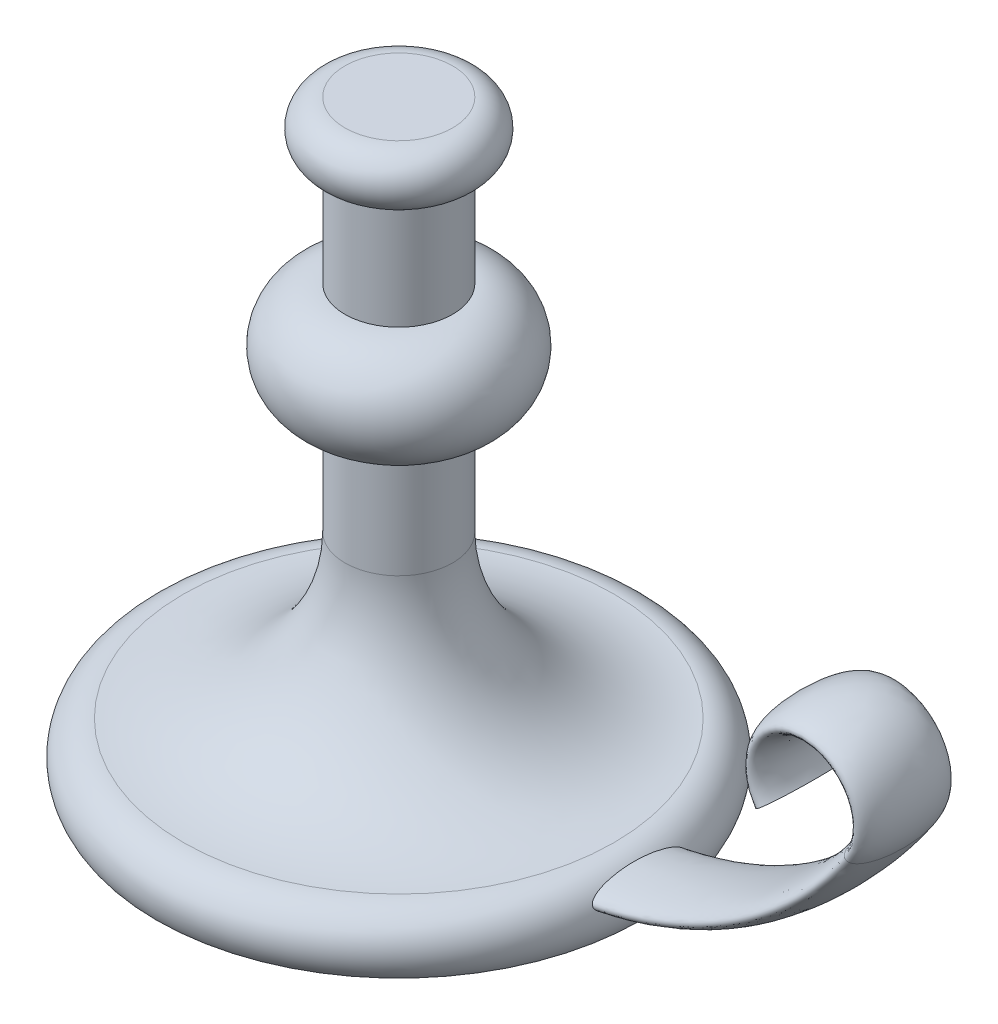
ISO-10303-21;
HEADER;
FILE_DESCRIPTION(('STEP AP214'),'2;1');
FILE_NAME('part.step','',(''),(''),'','','');
FILE_SCHEMA(('AUTOMOTIVE_DESIGN { 1 0 10303 214 1 1 1 1 }'));
ENDSEC;
DATA;
#1=APPLICATION_CONTEXT('core data for automotive mechanical design processes');
#2=APPLICATION_PROTOCOL_DEFINITION('international standard','automotive_design',2000,#1);
#3=PRODUCT_CONTEXT('',#1,'mechanical');
#4=PRODUCT('Part','Part','',(#3));
#5=PRODUCT_RELATED_PRODUCT_CATEGORY('part','',(#4));
#6=PRODUCT_DEFINITION_FORMATION('','',#4);
#7=PRODUCT_DEFINITION_CONTEXT('part definition',#1,'design');
#8=PRODUCT_DEFINITION('design','',#6,#7);
#9=PRODUCT_DEFINITION_SHAPE('','',#8);
#10=(LENGTH_UNIT() NAMED_UNIT(*) SI_UNIT(.MILLI.,.METRE.));
#11=(NAMED_UNIT(*) PLANE_ANGLE_UNIT() SI_UNIT($,.RADIAN.));
#12=(NAMED_UNIT(*) SI_UNIT($,.STERADIAN.) SOLID_ANGLE_UNIT());
#13=UNCERTAINTY_MEASURE_WITH_UNIT(LENGTH_MEASURE(1.E-05),#10,'distance_accuracy_value','');
#14=(GEOMETRIC_REPRESENTATION_CONTEXT(3) GLOBAL_UNCERTAINTY_ASSIGNED_CONTEXT((#13)) GLOBAL_UNIT_ASSIGNED_CONTEXT((#10,
#11,#12)) REPRESENTATION_CONTEXT('',''));
#15=CARTESIAN_POINT('',(0.,0.,0.));
#16=DIRECTION('',(0.,0.,1.));
#17=DIRECTION('',(1.,0.,0.));
#18=AXIS2_PLACEMENT_3D('',#15,#16,#17);
#19=CARTESIAN_POINT('',(0.,220.,0.));
#20=DIRECTION('',(0.,-1.,0.));
#21=DIRECTION('',(0.,0.,-1.));
#22=AXIS2_PLACEMENT_3D('',#19,#20,#21);
#23=PLANE('',#22);
#24=CARTESIAN_POINT('',(0.,220.,0.));
#25=DIRECTION('',(0.,1.,0.));
#26=DIRECTION('',(0.,0.,1.));
#27=AXIS2_PLACEMENT_3D('',#24,#25,#26);
#28=CIRCLE('',#27,20.);
#29=CARTESIAN_POINT('',(0.,220.,20.));
#30=VERTEX_POINT('',#29);
#31=EDGE_CURVE('E10',#30,#30,#28,.T.);
#32=ORIENTED_EDGE('',*,*,#31,.T.);
#33=EDGE_LOOP('',(#32));
#34=FACE_BOUND('',#33,.T.);
#35=ADVANCED_FACE('F39',(#34),#23,.F.);
#36=CARTESIAN_POINT('',(0.,210.,0.));
#37=DIRECTION('',(0.,1.,0.));
#38=DIRECTION('',(0.,0.,1.));
#39=AXIS2_PLACEMENT_3D('',#36,#37,#38);
#40=TOROIDAL_SURFACE('',#39,20.,9.99999999999999);
#41=ORIENTED_EDGE('',*,*,#31,.F.);
#42=EDGE_LOOP('',(#41));
#43=FACE_BOUND('',#42,.T.);
#44=CARTESIAN_POINT('',(0.,200.,0.));
#45=DIRECTION('',(0.,1.,0.));
#46=DIRECTION('',(0.,0.,1.));
#47=AXIS2_PLACEMENT_3D('',#44,#45,#46);
#48=CIRCLE('',#47,20.);
#49=CARTESIAN_POINT('',(0.,200.,20.));
#50=VERTEX_POINT('',#49);
#51=EDGE_CURVE('E52',#50,#50,#48,.T.);
#52=ORIENTED_EDGE('',*,*,#51,.T.);
#53=EDGE_LOOP('',(#52));
#54=FACE_BOUND('',#53,.T.);
#55=ADVANCED_FACE('F113',(#43,#54),#40,.T.);
#56=CARTESIAN_POINT('',(0.,220.,0.));
#57=DIRECTION('',(0.,1.,0.));
#58=DIRECTION('',(0.,0.,1.));
#59=AXIS2_PLACEMENT_3D('',#56,#57,#58);
#60=CYLINDRICAL_SURFACE('',#59,20.);
#61=ORIENTED_EDGE('',*,*,#51,.F.);
#62=EDGE_LOOP('',(#61));
#63=FACE_BOUND('',#62,.T.);
#64=CARTESIAN_POINT('',(0.,160.,0.));
#65=DIRECTION('',(0.,1.,0.));
#66=DIRECTION('',(0.,0.,1.));
#67=AXIS2_PLACEMENT_3D('',#64,#65,#66);
#68=CIRCLE('',#67,20.);
#69=CARTESIAN_POINT('',(0.,160.,20.));
#70=VERTEX_POINT('',#69);
#71=EDGE_CURVE('E57',#70,#70,#68,.T.);
#72=ORIENTED_EDGE('',*,*,#71,.T.);
#73=EDGE_LOOP('',(#72));
#74=FACE_BOUND('',#73,.T.);
#75=ADVANCED_FACE('F117',(#63,#74),#60,.T.);
#76=CARTESIAN_POINT('',(0.,140.,0.));
#77=DIRECTION('',(0.,1.,0.));
#78=DIRECTION('',(0.,0.,1.));
#79=AXIS2_PLACEMENT_3D('',#76,#77,#78);
#80=TOROIDAL_SURFACE('',#79,20.,20.);
#81=ORIENTED_EDGE('',*,*,#71,.F.);
#82=EDGE_LOOP('',(#81));
#83=FACE_BOUND('',#82,.T.);
#84=CARTESIAN_POINT('',(0.,120.,0.));
#85=DIRECTION('',(0.,1.,0.));
#86=DIRECTION('',(0.,0.,1.));
#87=AXIS2_PLACEMENT_3D('',#84,#85,#86);
#88=CIRCLE('',#87,20.);
#89=CARTESIAN_POINT('',(0.,120.,20.));
#90=VERTEX_POINT('',#89);
#91=EDGE_CURVE('E63',#90,#90,#88,.T.);
#92=ORIENTED_EDGE('',*,*,#91,.T.);
#93=EDGE_LOOP('',(#92));
#94=FACE_BOUND('',#93,.T.);
#95=ADVANCED_FACE('F122',(#83,#94),#80,.T.);
#96=CARTESIAN_POINT('',(0.,220.,0.));
#97=DIRECTION('',(0.,1.,0.));
#98=DIRECTION('',(0.,0.,1.));
#99=AXIS2_PLACEMENT_3D('',#96,#97,#98);
#100=CYLINDRICAL_SURFACE('',#99,20.);
#101=ORIENTED_EDGE('',*,*,#91,.F.);
#102=EDGE_LOOP('',(#101));
#103=FACE_BOUND('',#102,.T.);
#104=CARTESIAN_POINT('',(0.,80.,0.));
#105=DIRECTION('',(0.,1.,0.));
#106=DIRECTION('',(0.,0.,1.));
#107=AXIS2_PLACEMENT_3D('',#104,#105,#106);
#108=CIRCLE('',#107,20.);
#109=CARTESIAN_POINT('',(0.,80.,20.));
#110=VERTEX_POINT('',#109);
#111=EDGE_CURVE('E67',#110,#110,#108,.T.);
#112=ORIENTED_EDGE('',*,*,#111,.T.);
#113=EDGE_LOOP('',(#112));
#114=FACE_BOUND('',#113,.T.);
#115=ADVANCED_FACE('F129',(#103,#114),#100,.T.);
#116=CARTESIAN_POINT('',(0.,80.,0.));
#117=DIRECTION('',(0.,1.,0.));
#118=DIRECTION('',(0.,0.,1.));
#119=AXIS2_PLACEMENT_3D('',#116,#117,#118);
#120=TOROIDAL_SURFACE('',#119,80.,60.);
#121=ORIENTED_EDGE('',*,*,#111,.F.);
#122=EDGE_LOOP('',(#121));
#123=FACE_BOUND('',#122,.T.);
#124=CARTESIAN_POINT('',(0.,20.,0.));
#125=DIRECTION('',(0.,1.,0.));
#126=DIRECTION('',(0.,0.,1.));
#127=AXIS2_PLACEMENT_3D('',#124,#125,#126);
#128=CIRCLE('',#127,80.);
#129=CARTESIAN_POINT('',(0.,20.,80.));
#130=VERTEX_POINT('',#129);
#131=EDGE_CURVE('E71',#130,#130,#128,.T.);
#132=ORIENTED_EDGE('',*,*,#131,.T.);
#133=EDGE_LOOP('',(#132));
#134=FACE_BOUND('',#133,.T.);
#135=ADVANCED_FACE('F102',(#123,#134),#120,.F.);
#136=CARTESIAN_POINT('',(0.,7.50000000000001,0.));
#137=DIRECTION('',(0.,1.,0.));
#138=DIRECTION('',(0.,0.,1.));
#139=AXIS2_PLACEMENT_3D('',#136,#137,#138);
#140=TOROIDAL_SURFACE('',#139,79.9999999999999,12.5);
#141=CARTESIAN_POINT('',(89.5597422043341,12.9414346567555,-17.5));
#142=CARTESIAN_POINT('',(89.5807278946485,12.8988393157081,-17.5000019534777));
#143=CARTESIAN_POINT('',(89.6018125795404,12.8563039357769,-17.4977816975197));
#144=CARTESIAN_POINT('',(89.6440155813562,12.7716938339371,-17.489002543543));
#145=CARTESIAN_POINT('',(89.6651339056646,12.7296192360718,-17.4824425050804));
#146=CARTESIAN_POINT('',(89.7283289297819,12.6045076597417,-17.4565216692094));
#147=CARTESIAN_POINT('',(89.7702246464786,12.5226255894255,-17.4309204730636));
#148=CARTESIAN_POINT('',(89.8644276523312,12.3407735771966,-17.3563532007827));
#149=CARTESIAN_POINT('',(89.9162117483189,12.242484901666,-17.3027527423027));
#150=CARTESIAN_POINT('',(90.01638786814,12.0551458272008,-17.178826321144));
#151=CARTESIAN_POINT('',(90.0647710548456,11.966119226993,-17.1084587296403));
#152=CARTESIAN_POINT('',(90.1524531790238,11.806984522925,-16.9652391551481));
#153=CARTESIAN_POINT('',(90.1921458014335,11.7358878994478,-16.8936963434585));
#154=CARTESIAN_POINT('',(90.2690886261224,11.5996259068224,-16.7438969488311));
#155=CARTESIAN_POINT('',(90.3063367280021,11.5344656201532,-16.665634722265));
#156=CARTESIAN_POINT('',(90.3786756485819,11.4092540815105,-16.5039763875565));
#157=CARTESIAN_POINT('',(90.4137624747614,11.349212210629,-16.4205713158719));
#158=CARTESIAN_POINT('',(90.4819450166471,11.2336894025401,-16.2499454917114));
#159=CARTESIAN_POINT('',(90.5150413047902,11.1782071523834,-16.162725848809));
#160=CARTESIAN_POINT('',(90.58397059301,11.0637251825689,-15.9728919395737));
#161=CARTESIAN_POINT('',(90.6195406839562,11.0053156128849,-15.8698282905888));
#162=CARTESIAN_POINT('',(90.6886668526269,10.8929143897208,-15.6606649910659));
#163=CARTESIAN_POINT('',(90.7222226971281,10.8389232475745,-15.5545649910506));
#164=CARTESIAN_POINT('',(90.7874864861339,10.7348751403119,-15.3401290691865));
#165=CARTESIAN_POINT('',(90.8191972688172,10.6848120890841,-15.2317969483067));
#166=CARTESIAN_POINT('',(90.881005962979,10.5880683385414,-15.0131968985225));
#167=CARTESIAN_POINT('',(90.9111039714558,10.5413874357517,-14.9029290865687));
#168=CARTESIAN_POINT('',(90.9798973633521,10.4355491517099,-14.6427529331226));
#169=CARTESIAN_POINT('',(91.0180072010883,10.377593665576,-14.4922012075481));
#170=CARTESIAN_POINT('',(91.0918875553169,10.2663462891691,-14.1888070722871));
#171=CARTESIAN_POINT('',(91.1276577411367,10.2130550577559,-14.0359643425398));
#172=CARTESIAN_POINT('',(91.1971197458645,10.1105127689612,-13.7282685712582));
#173=CARTESIAN_POINT('',(91.2308091946811,10.0612662985098,-13.573413471871));
#174=CARTESIAN_POINT('',(91.2962483962877,9.96642044574798,-13.262180104172));
#175=CARTESIAN_POINT('',(91.3279980241888,9.92082129819992,-13.1058017385396));
#176=CARTESIAN_POINT('',(91.4205951755326,9.78887458660797,-12.6346162266685));
#177=CARTESIAN_POINT('',(91.478758906098,9.70742476979594,-12.3179025042442));
#178=CARTESIAN_POINT('',(91.5890957852253,9.55493826130151,-11.6792188898602));
#179=CARTESIAN_POINT('',(91.6412365063819,9.48395741425905,-11.357230318611));
#180=CARTESIAN_POINT('',(91.7397682682943,9.35136221163196,-10.7107316640823));
#181=CARTESIAN_POINT('',(91.7861636672356,9.28974074823245,-10.3862236929834));
#182=CARTESIAN_POINT('',(91.873697660451,9.17463718318051,-9.73512886653574));
#183=CARTESIAN_POINT('',(91.9148370779325,9.12115380666533,-9.4085423451682));
#184=CARTESIAN_POINT('',(91.9930777751441,9.02031209920315,-8.74630339912618));
#185=CARTESIAN_POINT('',(92.0300669877612,8.97311921137159,-8.41061269264342));
#186=CARTESIAN_POINT('',(92.0991833927575,8.88559842477434,-7.7378325274395));
#187=CARTESIAN_POINT('',(92.1313104056235,8.84527077946751,-7.40074301754617));
#188=CARTESIAN_POINT('',(92.1909161961866,8.77092313439267,-6.72537142355351));
#189=CARTESIAN_POINT('',(92.2183937480205,8.73690479789182,-6.38708904887197));
#190=CARTESIAN_POINT('',(92.2688480816039,8.674768403045,-5.70964427774296));
#191=CARTESIAN_POINT('',(92.2918247141674,8.64665054027192,-5.37048185250305));
#192=CARTESIAN_POINT('',(92.3540877228586,8.57076604630487,-4.35367181244674));
#193=CARTESIAN_POINT('',(92.3868571977359,8.53128338370554,-3.67498389641653));
#194=CARTESIAN_POINT('',(92.4356134743347,8.47274161832894,-2.31614711504077));
#195=CARTESIAN_POINT('',(92.4515998737813,8.45368300509714,-1.63599821506831));
#196=CARTESIAN_POINT('',(92.4661200478781,8.43637339284853,-0.357955102332014));
#197=CARTESIAN_POINT('',(92.4665389208555,8.43587490179706,0.2398888561436));
#198=CARTESIAN_POINT('',(92.4546362797528,8.45006241260828,1.43536153859161));
#199=CARTESIAN_POINT('',(92.4423128974782,8.46475064105844,2.0329902181484));
#200=CARTESIAN_POINT('',(92.4047541650815,8.50976680779928,3.22745109478544));
#201=CARTESIAN_POINT('',(92.3795147316879,8.54009969200436,3.82428298010726));
#202=CARTESIAN_POINT('',(92.3157217367252,8.61743320229675,5.01694606233265));
#203=CARTESIAN_POINT('',(92.2771508465327,8.66445552395919,5.61277493756135));
#204=CARTESIAN_POINT('',(92.1861026743767,8.77678784246256,6.80153886380948));
#205=CARTESIAN_POINT('',(92.1336290020918,8.842093092625,7.394474625351));
#206=CARTESIAN_POINT('',(92.0437550848418,8.95574227206712,8.28055229820525));
#207=CARTESIAN_POINT('',(92.0119455213755,8.99622894552014,8.57528682166739));
#208=CARTESIAN_POINT('',(91.9444204496404,9.08291539794889,9.16346094428898));
#209=CARTESIAN_POINT('',(91.9087051114864,9.12911492811459,9.45690059926729));
#210=CARTESIAN_POINT('',(91.8331309715697,9.2278292933407,10.0422906036685));
#211=CARTESIAN_POINT('',(91.7932707518513,9.28034629056384,10.334240407347));
#212=CARTESIAN_POINT('',(91.7091179167369,9.39245062081633,10.9161852811054));
#213=CARTESIAN_POINT('',(91.6648247441271,9.45203884286033,11.2061801005454));
#214=CARTESIAN_POINT('',(91.571392572748,9.57931645333883,11.783819165817));
#215=CARTESIAN_POINT('',(91.5222504482681,9.64701107336928,12.0714617643074));
#216=CARTESIAN_POINT('',(91.4186796874405,9.7917273008591,12.6430805537633));
#217=CARTESIAN_POINT('',(91.3642572573634,9.868737984241,12.9270606150357));
#218=CARTESIAN_POINT('',(91.2493765391174,10.0339529747881,13.4904217181468));
#219=CARTESIAN_POINT('',(91.1889212109096,10.1221517983455,13.769804937745));
#220=CARTESIAN_POINT('',(91.0929373870873,10.2648274882364,14.1839125047649));
#221=CARTESIAN_POINT('',(91.0600757486261,10.314090418185,14.3210581267389));
#222=CARTESIAN_POINT('',(90.9923938569385,10.4165511027193,14.5933763477652));
#223=CARTESIAN_POINT('',(90.9575737807135,10.4697485018484,14.7285491237347));
#224=CARTESIAN_POINT('',(90.8810851838776,10.587845134408,15.013877492368));
#225=CARTESIAN_POINT('',(90.8391147723956,10.6533666208413,15.163696910475));
#226=CARTESIAN_POINT('',(90.7519625692611,10.7912189771816,15.4593295355901));
#227=CARTESIAN_POINT('',(90.7067794219567,10.8635527258308,15.605141014985));
#228=CARTESIAN_POINT('',(90.6128939496974,11.0160439629677,15.8905749729623));
#229=CARTESIAN_POINT('',(90.564208454431,11.0961646105686,16.0302224467125));
#230=CARTESIAN_POINT('',(90.4624897667353,11.2662530107872,16.3016394850687));
#231=CARTESIAN_POINT('',(90.4094613083908,11.3562100760681,16.4334173639363));
#232=CARTESIAN_POINT('',(90.3114276481006,11.5255085385047,16.6553108138959));
#233=CARTESIAN_POINT('',(90.2675273757817,11.6022608890605,16.747864447136));
#234=CARTESIAN_POINT('',(90.1761749534326,11.7643292238686,16.9236630994731));
#235=CARTESIAN_POINT('',(90.1287172073377,11.849658775493,17.0068929161981));
#236=CARTESIAN_POINT('',(90.0292807633425,12.0313291797368,17.160728121925));
#237=CARTESIAN_POINT('',(89.9772518064337,12.1277974407354,17.2311575389091));
#238=CARTESIAN_POINT('',(89.8965437818878,12.2800613987942,17.3212876850735));
#239=CARTESIAN_POINT('',(89.8692277989252,12.3320164153137,17.3487242132162));
#240=CARTESIAN_POINT('',(89.8138320311431,12.4382955168478,17.397521114568));
#241=CARTESIAN_POINT('',(89.7857527202501,12.4926181439799,17.4188851676711));
#242=CARTESIAN_POINT('',(89.7185869780335,12.62370480056,17.4611772226903));
#243=CARTESIAN_POINT('',(89.6792533408886,12.7013692224277,17.4790502108364));
#244=CARTESIAN_POINT('',(89.6005512815563,12.8586256339486,17.4997317533413));
#245=CARTESIAN_POINT('',(89.5611829132232,12.938216013995,17.5025524785485));
#246=CARTESIAN_POINT('',(89.4835317885696,13.0969633423244,17.4927372657774));
#247=CARTESIAN_POINT('',(89.4452490812936,13.1761202708965,17.48010063065));
#248=CARTESIAN_POINT('',(89.3707047667354,13.3318071774564,17.440649407729));
#249=CARTESIAN_POINT('',(89.3344452993771,13.4083343423532,17.4138201116179));
#250=CARTESIAN_POINT('',(89.2510611220234,13.5858554385684,17.3357126521072));
#251=CARTESIAN_POINT('',(89.2050998650831,13.6849823777221,17.279004762084));
#252=CARTESIAN_POINT('',(89.1180744174555,13.874427631182,17.1491670423826));
#253=CARTESIAN_POINT('',(89.0770301058258,13.9647099356687,17.0759737821297));
#254=CARTESIAN_POINT('',(89.0037033744711,14.1271434857572,16.9270577307039));
#255=CARTESIAN_POINT('',(88.9709541551902,14.2001945680733,16.8525208708985));
#256=CARTESIAN_POINT('',(88.9084968426189,14.340181169045,16.6970292692109));
#257=CARTESIAN_POINT('',(88.8787841266133,14.407125966577,16.6160846261891));
#258=CARTESIAN_POINT('',(88.8217814388548,14.5359995630884,16.4490709627677));
#259=CARTESIAN_POINT('',(88.7944998605826,14.5979109242413,16.3629857823209));
#260=CARTESIAN_POINT('',(88.7420667437369,14.7171734064661,16.1870697873629));
#261=CARTESIAN_POINT('',(88.7169159331092,14.7745229686602,16.0972377082949));
#262=CARTESIAN_POINT('',(88.6682699235336,14.8855899090514,15.914069930646));
#263=CARTESIAN_POINT('',(88.6447869137155,14.9392804489427,15.8207148279057));
#264=CARTESIAN_POINT('',(88.5993971939426,15.0431008843884,15.631662696143));
#265=CARTESIAN_POINT('',(88.5774907604157,15.0932301555103,15.5359652603521));
#266=CARTESIAN_POINT('',(88.5137514786219,15.2390285874188,15.2458062448784));
#267=CARTESIAN_POINT('',(88.4739596847912,15.3299685477361,15.0485147207844));
#268=CARTESIAN_POINT('',(88.3985337506614,15.5017775203628,14.6487152633384));
#269=CARTESIAN_POINT('',(88.3629029634838,15.5826384140042,14.4462032813469));
#270=CARTESIAN_POINT('',(88.2948356711211,15.7363066128674,14.0365764701684));
#271=CARTESIAN_POINT('',(88.2624142295168,15.8090761199818,13.8294450545344));
#272=CARTESIAN_POINT('',(88.200383575138,15.9473648801959,13.4126289871754));
#273=CARTESIAN_POINT('',(88.1707714189813,16.0128917338225,13.2029472733575));
#274=CARTESIAN_POINT('',(88.1139049361937,16.1377375745623,12.7814949946293));
#275=CARTESIAN_POINT('',(88.0866500408507,16.1970580597506,12.5697249473619));
#276=CARTESIAN_POINT('',(88.0276172572029,16.3244235662308,12.0912931700768));
#277=CARTESIAN_POINT('',(87.9964138193043,16.3909381265497,11.8241540502334));
#278=CARTESIAN_POINT('',(87.9367717636616,16.5165936764723,11.2878278414637));
#279=CARTESIAN_POINT('',(87.908333416442,16.5757339447663,11.0186405549261));
#280=CARTESIAN_POINT('',(87.853926628297,16.687509894896,10.4785408424869));
#281=CARTESIAN_POINT('',(87.8279593730486,16.7401424577998,10.2076276543179));
#282=CARTESIAN_POINT('',(87.778318430933,16.8395301522939,9.66451167999671));
#283=CARTESIAN_POINT('',(87.7546448506394,16.8862850108121,9.39230883453762));
#284=CARTESIAN_POINT('',(87.6869994555323,17.0182803050951,8.57578965921611));
#285=CARTESIAN_POINT('',(87.6462388525845,17.095585400369,8.02991167225266));
#286=CARTESIAN_POINT('',(87.572806551561,17.2320145687305,6.93552385093793));
#287=CARTESIAN_POINT('',(87.540133067568,17.291142656633,6.38701462497871));
#288=CARTESIAN_POINT('',(87.4828441952969,17.3930876120977,5.28955884850666));
#289=CARTESIAN_POINT('',(87.458207458868,17.4359477429325,4.74061740412309));
#290=CARTESIAN_POINT('',(87.4169410999171,17.5068884934703,3.6414610821848));
#291=CARTESIAN_POINT('',(87.4003119088602,17.534968316784,3.09124613761564));
#292=CARTESIAN_POINT('',(87.3751699481989,17.5771566462026,1.98980868968976));
#293=CARTESIAN_POINT('',(87.3666614689743,17.5912577671532,1.43858580771881));
#294=CARTESIAN_POINT('',(87.3578539704595,17.6058511840596,0.335909067642977));
#295=CARTESIAN_POINT('',(87.3575547550007,17.6063438052041,-0.215544784627731));
#296=CARTESIAN_POINT('',(87.3651677510508,17.5937352162512,-1.31815822776498));
#297=CARTESIAN_POINT('',(87.3730787250644,17.5806360547995,-1.86931785045355));
#298=CARTESIAN_POINT('',(87.3970372477743,17.5404868292745,-2.97097544678));
#299=CARTESIAN_POINT('',(87.4130850653539,17.5134363041759,-3.52147339795022));
#300=CARTESIAN_POINT('',(87.4531996813082,17.4446213827574,-4.6211213566709));
#301=CARTESIAN_POINT('',(87.4772644593793,17.4028606933017,-5.17027166874449));
#302=CARTESIAN_POINT('',(87.5333316774063,17.3033707612728,-6.26670053623853));
#303=CARTESIAN_POINT('',(87.5653334299484,17.2456429015512,-6.8139792495971));
#304=CARTESIAN_POINT('',(87.6208220531233,17.142904950908,-7.65503321384091));
#305=CARTESIAN_POINT('',(87.6414679669262,17.1042333246736,-7.94978028809209));
#306=CARTESIAN_POINT('',(87.6851649593459,17.0212250701549,-8.5382946276253));
#307=CARTESIAN_POINT('',(87.7082159678753,16.9768886069422,-8.83206192120198));
#308=CARTESIAN_POINT('',(87.756810669134,16.8820510369674,-9.41827197237173));
#309=CARTESIAN_POINT('',(87.7823533406003,16.831552453774,-9.71071522165114));
#310=CARTESIAN_POINT('',(87.8360989952267,16.7237193681044,-10.2940938312777));
#311=CARTESIAN_POINT('',(87.864301890956,16.6663850902736,-10.5850292408502));
#312=CARTESIAN_POINT('',(87.914771249955,16.5622842610499,-11.0784529887248));
#313=CARTESIAN_POINT('',(87.9362980252957,16.5174691899784,-11.2814293835359));
#314=CARTESIAN_POINT('',(87.9809118301306,16.4236835134746,-11.6862455623099));
#315=CARTESIAN_POINT('',(88.0039988123356,16.3747130339798,-11.8880853805213));
#316=CARTESIAN_POINT('',(88.0519198244945,16.2721215384755,-12.2905621648864));
#317=CARTESIAN_POINT('',(88.0767553337326,16.2184965755424,-12.4911979528433));
#318=CARTESIAN_POINT('',(88.128378700467,16.1060707847334,-12.8907612736856));
#319=CARTESIAN_POINT('',(88.1551664933025,16.0472701282659,-13.0896888629038));
#320=CARTESIAN_POINT('',(88.2109999780507,15.9237718205571,-13.4854201231427));
#321=CARTESIAN_POINT('',(88.2400459194861,15.8590735174959,-13.6822235567026));
#322=CARTESIAN_POINT('',(88.3008027999435,15.7228691935847,-14.0730419872912));
#323=CARTESIAN_POINT('',(88.3325134779587,15.6513638393838,-14.2670572552416));
#324=CARTESIAN_POINT('',(88.3991424541963,15.5003948115853,-14.6511973591152));
#325=CARTESIAN_POINT('',(88.4340575115819,15.4209391715419,-14.8413258930676));
#326=CARTESIAN_POINT('',(88.5079196083052,15.2523848762558,-15.2164401400184));
#327=CARTESIAN_POINT('',(88.5468648114134,15.1632906117643,-15.4014281468506));
#328=CARTESIAN_POINT('',(88.6092096238855,15.0206579718863,-15.6733114229656));
#329=CARTESIAN_POINT('',(88.6306485895104,14.9716086740018,-15.7630166800383));
#330=CARTESIAN_POINT('',(88.6750422753315,14.8701248615215,-15.9401002079384));
#331=CARTESIAN_POINT('',(88.6979967332499,14.8176909327193,-16.0274788777608));
#332=CARTESIAN_POINT('',(88.7456840101801,14.7089478844269,-16.1993887567141));
#333=CARTESIAN_POINT('',(88.7704179688272,14.6526362825887,-16.2839180892549));
#334=CARTESIAN_POINT('',(88.8219484857481,14.5356422617901,-16.4492391224758));
#335=CARTESIAN_POINT('',(88.8487445345049,14.4749609227741,-16.5300317386034));
#336=CARTESIAN_POINT('',(88.8976102788188,14.3647434848946,-16.6667168433053));
#337=CARTESIAN_POINT('',(88.9191374191611,14.3163230322077,-16.7236955334948));
#338=CARTESIAN_POINT('',(88.963708067647,14.2164452982155,-16.8342912802677));
#339=CARTESIAN_POINT('',(88.9867519478515,14.1649872721059,-16.887907505682));
#340=CARTESIAN_POINT('',(89.0583610181502,14.0058008216793,-17.0423310846558));
#341=CARTESIAN_POINT('',(89.1095289234107,13.8929758416953,-17.1370796109728));
#342=CARTESIAN_POINT('',(89.1999001554577,13.696338620897,-17.2707956184668));
#343=CARTESIAN_POINT('',(89.2367505169324,13.6167644879678,-17.3175503480632));
#344=CARTESIAN_POINT('',(89.3136877653852,13.4522974166007,-17.3968468737188));
#345=CARTESIAN_POINT('',(89.3537667767869,13.3674175273961,-17.4294220837182));
#346=CARTESIAN_POINT('',(89.4217091217895,13.2251848973538,-17.4685967336684));
#347=CARTESIAN_POINT('',(89.4488093840981,13.1688551716173,-17.4803204652976));
#348=CARTESIAN_POINT('',(89.5037947740349,13.055459493497,-17.4960211898048));
#349=CARTESIAN_POINT('',(89.5316799819,12.998393466174,-17.499997387795));
#350=CARTESIAN_POINT('',(89.5597422043341,12.9414346567555,-17.5));
#351=B_SPLINE_CURVE_WITH_KNOTS('',3,(#141,#142,#143,#144,#145,#146,#147,#148,#149,#150,#151,
#152,#153,#154,#155,#156,#157,#158,#159,#160,#161,#162,#163,#164,#165,#166,#167,#168,#169,#170,
#171,#172,#173,#174,#175,#176,#177,#178,#179,#180,#181,#182,#183,#184,#185,#186,#187,#188,#189,
#190,#191,#192,#193,#194,#195,#196,#197,#198,#199,#200,#201,#202,#203,#204,#205,#206,#207,#208,
#209,#210,#211,#212,#213,#214,#215,#216,#217,#218,#219,#220,#221,#222,#223,#224,#225,#226,#227,
#228,#229,#230,#231,#232,#233,#234,#235,#236,#237,#238,#239,#240,#241,#242,#243,#244,#245,#246,
#247,#248,#249,#250,#251,#252,#253,#254,#255,#256,#257,#258,#259,#260,#261,#262,#263,#264,#265,
#266,#267,#268,#269,#270,#271,#272,#273,#274,#275,#276,#277,#278,#279,#280,#281,#282,#283,#284,
#285,#286,#287,#288,#289,#290,#291,#292,#293,#294,#295,#296,#297,#298,#299,#300,#301,#302,#303,
#304,#305,#306,#307,#308,#309,#310,#311,#312,#313,#314,#315,#316,#317,#318,#319,#320,#321,#322,
#323,#324,#325,#326,#327,#328,#329,#330,#331,#332,#333,#334,#335,#336,#337,#338,#339,#340,#341,
#342,#343,#344,#345,#346,#347,#348,#349,#350),.UNSPECIFIED.,.T.,.F.,(4,2,2,2,2,2,2,2,2,2,2,2,2,
2,2,2,2,2,2,2,2,2,2,2,2,2,2,2,2,2,2,2,2,2,2,2,2,2,2,2,2,2,2,2,2,2,2,2,2,2,2,2,2,2,2,2,2,2,2,2,2,
2,2,2,2,2,2,2,2,2,2,2,2,2,2,2,2,2,2,2,2,2,2,2,2,2,2,2,2,2,2,2,2,2,2,2,2,2,2,2,2,2,2,2,4),(0.,
0.142381357158824,0.284800145338817,0.569778369710414,0.937790990160531,1.30672699797603,
1.63143353328553,1.9564155082417,2.28198085179475,2.60745211744529,2.97835758825746,
3.34930592253142,3.71966767593574,4.09000712931064,4.58717127025776,5.08440552627602,
5.58219609730418,6.08001868322202,7.07612740491146,8.07737111401414,9.07785060328474,
10.0781732018629,11.1010679437462,12.1240004418369,13.1472022244407,14.1704379160042,
16.2117115539474,18.2530341182272,20.0462457692419,21.8397203676841,23.6337623045227,
25.4301450150666,27.2260617741976,28.1235892294179,29.0210776087005,29.9188740333849,
30.8167834514324,31.7152755049923,32.612724011572,33.5097343419006,33.9578247270818,
34.4058746792332,34.912160474794,35.418661186117,35.9228725276492,36.4265413835618,
36.8100240505595,37.1941231504199,37.5831580539593,37.7772586450042,37.9712413599169,
38.2366258142319,38.5017956533801,38.7669774525071,39.0324346081149,39.399655598355,
39.7683144393123,40.0959866375242,40.4231523204131,40.7514069982215,41.079773371008,
41.4103344436383,41.7409533344657,42.4030339566276,43.0656444835739,43.7312306850959,
44.3961116446164,45.0608317450513,45.8918608553089,46.7229711882512,47.554478313977,
48.3860240564165,50.0440426041193,51.7016946763031,53.3549069476207,55.0082082878475,
56.662382626736,58.3165174374207,59.9704029618952,61.6243431428235,63.2778668395668,
64.9312473761705,65.8251617717441,66.7190501248725,67.612573625424,68.5060677696864,
69.1329546330692,69.7598225042316,70.3872272415112,71.0146112082232,71.6420645989532,
72.2694566030676,72.8962209263468,73.5227009279533,73.8360175198407,74.1492800292309,
74.4627449766603,74.7761327179497,75.0094189443196,75.2427626113348,75.7080186392224,
76.0052441465118,76.3017654013246,76.4921392885521,76.6825327068869),.UNSPECIFIED.);
#352=CARTESIAN_POINT('',(89.5597422043341,12.9414346567555,-17.5));
#353=VERTEX_POINT('',#352);
#354=EDGE_CURVE('E42',#353,#353,#351,.T.);
#355=ORIENTED_EDGE('',*,*,#354,.T.);
#356=EDGE_LOOP('',(#355));
#357=FACE_BOUND('',#356,.T.);
#358=ORIENTED_EDGE('',*,*,#131,.F.);
#359=EDGE_LOOP('',(#358));
#360=FACE_BOUND('',#359,.T.);
#361=CARTESIAN_POINT('',(0.,0.,0.));
#362=DIRECTION('',(0.,1.,0.));
#363=DIRECTION('',(0.,0.,1.));
#364=AXIS2_PLACEMENT_3D('',#361,#362,#363);
#365=CIRCLE('',#364,90.);
#366=CARTESIAN_POINT('',(0.,0.,90.));
#367=VERTEX_POINT('',#366);
#368=EDGE_CURVE('E75',#367,#367,#365,.T.);
#369=ORIENTED_EDGE('',*,*,#368,.T.);
#370=EDGE_LOOP('',(#369));
#371=FACE_BOUND('',#370,.T.);
#372=ADVANCED_FACE('F99',(#357,#360,#371),#140,.T.);
#373=CARTESIAN_POINT('',(0.,0.,0.));
#374=DIRECTION('',(0.,1.,0.));
#375=DIRECTION('',(0.,0.,1.));
#376=AXIS2_PLACEMENT_3D('',#373,#374,#375);
#377=PLANE('',#376);
#378=ORIENTED_EDGE('',*,*,#368,.F.);
#379=EDGE_LOOP('',(#378));
#380=FACE_BOUND('',#379,.T.);
#381=ADVANCED_FACE('F94',(#380),#377,.F.);
#382=CARTESIAN_POINT('',(60.,10.,-17.5));
#383=CARTESIAN_POINT('',(110.410191303973,10.,-17.5));
#384=CARTESIAN_POINT('',(155.026295870831,33.4646670673665,-17.5));
#385=CARTESIAN_POINT('',(183.592070943083,75.,-17.5));
#386=CARTESIAN_POINT('',(60.,20.,-17.5));
#387=CARTESIAN_POINT('',(107.049511883708,20.,-17.5));
#388=CARTESIAN_POINT('',(148.691209479443,41.9003559295421,-17.5));
#389=CARTESIAN_POINT('',(175.352599546877,80.6666666666666,-17.5));
#390=CARTESIAN_POINT('',(60.,20.,17.5));
#391=CARTESIAN_POINT('',(107.049511883708,20.,17.5));
#392=CARTESIAN_POINT('',(148.691209479443,41.9003559295421,17.5));
#393=CARTESIAN_POINT('',(175.352599546877,80.6666666666666,17.5));
#394=CARTESIAN_POINT('',(60.,10.,17.5));
#395=CARTESIAN_POINT('',(110.410191303973,10.,17.5));
#396=CARTESIAN_POINT('',(155.026295870831,33.4646670673665,17.5));
#397=CARTESIAN_POINT('',(183.592070943083,75.,17.5));
#398=CARTESIAN_POINT('',(60.,0.,17.5));
#399=CARTESIAN_POINT('',(113.770870724238,0.,17.5));
#400=CARTESIAN_POINT('',(161.36138226222,25.0289782051909,17.5));
#401=CARTESIAN_POINT('',(191.831542339288,69.3333333333333,17.5));
#402=CARTESIAN_POINT('',(60.,0.,-17.5));
#403=CARTESIAN_POINT('',(113.770870724238,0.,-17.5));
#404=CARTESIAN_POINT('',(161.36138226222,25.0289782051909,-17.5));
#405=CARTESIAN_POINT('',(191.831542339288,69.3333333333333,-17.5));
#406=CARTESIAN_POINT('',(60.,10.,-17.5));
#407=CARTESIAN_POINT('',(110.410191303973,10.,-17.5));
#408=CARTESIAN_POINT('',(155.026295870831,33.4646670673665,-17.5));
#409=CARTESIAN_POINT('',(183.592070943083,75.,-17.5));
#410=(BOUNDED_SURFACE() B_SPLINE_SURFACE(3,3,((#382,#383,#384,#385),(#386,#387,#388,#389),(#390,
#391,#392,#393),(#394,#395,#396,#397),(#398,#399,#400,#401),(#402,#403,#404,#405),(#406,#407,
#408,#409)),.UNSPECIFIED.,.T.,.F.,.F.) B_SPLINE_SURFACE_WITH_KNOTS((4,3,4),(4,4),(0.,0.5,1.),
(0.,1.),.UNSPECIFIED.) GEOMETRIC_REPRESENTATION_ITEM() RATIONAL_B_SPLINE_SURFACE(((1.,
0.923374135437856,0.923374135437856,1.),(0.333333333333333,0.307791378479285,0.307791378479285,
0.333333333333333),(0.333333333333333,0.307791378479285,0.307791378479285,0.333333333333333),
(1.,0.923374135437856,0.923374135437856,1.),(0.333333333333333,0.307791378479285,
0.307791378479285,0.333333333333333),(0.333333333333333,0.307791378479285,0.307791378479285,
0.333333333333333),(1.,0.923374135437856,0.923374135437856,1.))) REPRESENTATION_ITEM('') SURFACE());
#411=CARTESIAN_POINT('',(183.592070943083,75.,0.));
#412=DIRECTION('',(0.566666666666667,0.823947139620552,0.));
#413=DIRECTION('',(0.,0.,-1.));
#414=AXIS2_PLACEMENT_3D('',#411,#412,#413);
#415=ELLIPSE('',#414,17.5,5.);
#416=CARTESIAN_POINT('',(183.592070943083,75.,-17.5));
#417=VERTEX_POINT('',#416);
#418=EDGE_CURVE('E83',#417,#417,#415,.T.);
#419=ORIENTED_EDGE('',*,*,#418,.F.);
#420=EDGE_LOOP('',(#419));
#421=FACE_BOUND('',#420,.T.);
#422=ORIENTED_EDGE('',*,*,#354,.F.);
#423=EDGE_LOOP('',(#422));
#424=FACE_BOUND('',#423,.T.);
#425=ADVANCED_FACE('F90',(#421,#424),#410,.T.);
#426=CARTESIAN_POINT('',(150.634185358261,75.,0.));
#427=DIRECTION('',(0.566666666666667,-0.823947139620552,0.));
#428=DIRECTION('',(0.,0.,-1.));
#429=AXIS2_PLACEMENT_3D('',#426,#427,#428);
#430=PLANE('',#429);
#431=CARTESIAN_POINT('',(150.634185358261,75.,0.));
#432=DIRECTION('',(0.566666666666667,-0.823947139620552,0.));
#433=DIRECTION('',(0.,0.,-1.));
#434=AXIS2_PLACEMENT_3D('',#431,#432,#433);
#435=ELLIPSE('',#434,17.5,5.);
#436=CARTESIAN_POINT('',(150.634185358261,75.,-17.5));
#437=VERTEX_POINT('',#436);
#438=EDGE_CURVE('E79',#437,#437,#435,.T.);
#439=ORIENTED_EDGE('',*,*,#438,.T.);
#440=EDGE_LOOP('',(#439));
#441=FACE_BOUND('',#440,.T.);
#442=ADVANCED_FACE('F93',(#441),#430,.T.);
#443=CARTESIAN_POINT('',(183.592070943083,75.,-17.5));
#444=CARTESIAN_POINT('',(193.981461744242,90.10642735238,-17.5));
#445=CARTESIAN_POINT('',(185.447347211541,106.333333333333,-17.5));
#446=CARTESIAN_POINT('',(167.113128150672,106.333333333333,-17.5));
#447=CARTESIAN_POINT('',(148.778909089802,106.333333333333,-17.5));
#448=CARTESIAN_POINT('',(140.244794557101,90.1064273523801,-17.5));
#449=CARTESIAN_POINT('',(150.634185358261,75.,-17.5));
#450=CARTESIAN_POINT('',(175.352599546877,80.6666666666667,-17.5));
#451=CARTESIAN_POINT('',(180.547294947457,88.2198803428567,-17.5));
#452=CARTESIAN_POINT('',(176.280237681106,96.3333333333333,-17.5));
#453=CARTESIAN_POINT('',(167.113128150672,96.3333333333333,-17.5));
#454=CARTESIAN_POINT('',(157.946018620237,96.3333333333333,-17.5));
#455=CARTESIAN_POINT('',(153.678961353886,88.2198803428566,-17.5));
#456=CARTESIAN_POINT('',(158.873656754466,80.6666666666666,-17.5));
#457=CARTESIAN_POINT('',(175.352599546877,80.6666666666667,17.5));
#458=CARTESIAN_POINT('',(180.547294947457,88.2198803428567,17.5));
#459=CARTESIAN_POINT('',(176.280237681106,96.3333333333333,17.5));
#460=CARTESIAN_POINT('',(167.113128150672,96.3333333333333,17.5));
#461=CARTESIAN_POINT('',(157.946018620237,96.3333333333333,17.5));
#462=CARTESIAN_POINT('',(153.678961353886,88.2198803428566,17.5));
#463=CARTESIAN_POINT('',(158.873656754466,80.6666666666666,17.5));
#464=CARTESIAN_POINT('',(183.592070943083,75.,17.5));
#465=CARTESIAN_POINT('',(193.981461744242,90.10642735238,17.5));
#466=CARTESIAN_POINT('',(185.447347211541,106.333333333333,17.5));
#467=CARTESIAN_POINT('',(167.113128150672,106.333333333333,17.5));
#468=CARTESIAN_POINT('',(148.778909089802,106.333333333333,17.5));
#469=CARTESIAN_POINT('',(140.244794557101,90.1064273523801,17.5));
#470=CARTESIAN_POINT('',(150.634185358261,75.,17.5));
#471=CARTESIAN_POINT('',(191.831542339288,69.3333333333333,17.5));
#472=CARTESIAN_POINT('',(207.415628541027,91.9929743619034,17.5));
#473=CARTESIAN_POINT('',(194.614456741976,116.333333333333,17.5));
#474=CARTESIAN_POINT('',(167.113128150672,116.333333333333,17.5));
#475=CARTESIAN_POINT('',(139.611799559367,116.333333333333,17.5));
#476=CARTESIAN_POINT('',(126.810627760316,91.9929743619034,17.5));
#477=CARTESIAN_POINT('',(142.394713962055,69.3333333333333,17.5));
#478=CARTESIAN_POINT('',(191.831542339288,69.3333333333333,-17.5));
#479=CARTESIAN_POINT('',(207.415628541027,91.9929743619034,-17.5));
#480=CARTESIAN_POINT('',(194.614456741976,116.333333333333,-17.5));
#481=CARTESIAN_POINT('',(167.113128150672,116.333333333333,-17.5));
#482=CARTESIAN_POINT('',(139.611799559367,116.333333333333,-17.5));
#483=CARTESIAN_POINT('',(126.810627760316,91.9929743619034,-17.5));
#484=CARTESIAN_POINT('',(142.394713962055,69.3333333333333,-17.5));
#485=CARTESIAN_POINT('',(183.592070943083,75.,-17.5));
#486=CARTESIAN_POINT('',(193.981461744242,90.10642735238,-17.5));
#487=CARTESIAN_POINT('',(185.447347211541,106.333333333333,-17.5));
#488=CARTESIAN_POINT('',(167.113128150672,106.333333333333,-17.5));
#489=CARTESIAN_POINT('',(148.778909089802,106.333333333333,-17.5));
#490=CARTESIAN_POINT('',(140.244794557101,90.1064273523801,-17.5));
#491=CARTESIAN_POINT('',(150.634185358261,75.,-17.5));
#492=(BOUNDED_SURFACE() B_SPLINE_SURFACE(3,3,((#443,#444,#445,#446,#447,#448,#449),(#450,#451,
#452,#453,#454,#455,#456),(#457,#458,#459,#460,#461,#462,#463),(#464,#465,#466,#467,#468,#469,
#470),(#471,#472,#473,#474,#475,#476,#477),(#478,#479,#480,#481,#482,#483,#484),(#485,#486,#487,
#488,#489,#490,#491)),.UNSPECIFIED.,.T.,.F.,.F.) B_SPLINE_SURFACE_WITH_KNOTS((4,3,4),(4,3,4),
(0.,0.5,1.),(0.,0.5,1.),
.UNSPECIFIED.) GEOMETRIC_REPRESENTATION_ITEM() RATIONAL_B_SPLINE_SURFACE(((1.,0.643649778750421,
0.643649778750421,1.,0.643649778750421,0.643649778750421,1.),(0.333333333333333,
0.21454992625014,0.21454992625014,0.333333333333333,0.21454992625014,0.21454992625014,
0.333333333333333),(0.333333333333333,0.21454992625014,0.21454992625014,0.333333333333333,
0.21454992625014,0.21454992625014,0.333333333333333),(1.,0.643649778750421,0.643649778750421,1.,
0.643649778750421,0.643649778750421,1.),(0.333333333333333,0.21454992625014,0.21454992625014,
0.333333333333333,0.21454992625014,0.21454992625014,0.333333333333333),(0.333333333333333,
0.21454992625014,0.21454992625014,0.333333333333333,0.21454992625014,0.21454992625014,
0.333333333333333),(1.,0.643649778750421,0.643649778750421,1.,0.643649778750421,
0.643649778750421,1.))) REPRESENTATION_ITEM('') SURFACE());
#493=ORIENTED_EDGE('',*,*,#438,.F.);
#494=EDGE_LOOP('',(#493));
#495=FACE_BOUND('',#494,.T.);
#496=ORIENTED_EDGE('',*,*,#418,.T.);
#497=EDGE_LOOP('',(#496));
#498=FACE_BOUND('',#497,.T.);
#499=ADVANCED_FACE('F88',(#495,#498),#492,.T.);
#500=CLOSED_SHELL('',(#35,#55,#75,#95,#115,#135,#372,#381,#425,#442,#499));
#501=MANIFOLD_SOLID_BREP('B2',#500);
#502=ADVANCED_BREP_SHAPE_REPRESENTATION('',(#18,#501),#14);
#503=SHAPE_DEFINITION_REPRESENTATION(#9,#502);
ENDSEC;
END-ISO-10303-21;
